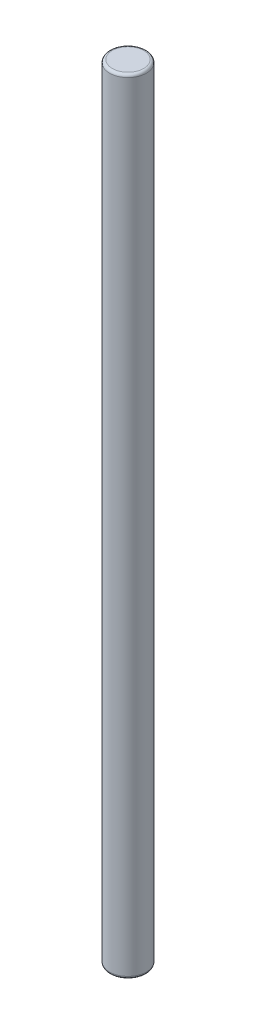
ISO-10303-21;
HEADER;
FILE_DESCRIPTION(('STEP AP214'),'2;1');
FILE_NAME('part.step','',(''),(''),'','','');
FILE_SCHEMA(('AUTOMOTIVE_DESIGN { 1 0 10303 214 1 1 1 1 }'));
ENDSEC;
DATA;
#1=APPLICATION_CONTEXT('core data for automotive mechanical design processes');
#2=APPLICATION_PROTOCOL_DEFINITION('international standard','automotive_design',2000,#1);
#3=PRODUCT_CONTEXT('',#1,'mechanical');
#4=PRODUCT('Part','Part','',(#3));
#5=PRODUCT_RELATED_PRODUCT_CATEGORY('part','',(#4));
#6=PRODUCT_DEFINITION_FORMATION('','',#4);
#7=PRODUCT_DEFINITION_CONTEXT('part definition',#1,'design');
#8=PRODUCT_DEFINITION('design','',#6,#7);
#9=PRODUCT_DEFINITION_SHAPE('','',#8);
#10=(LENGTH_UNIT() NAMED_UNIT(*) SI_UNIT(.MILLI.,.METRE.));
#11=(NAMED_UNIT(*) PLANE_ANGLE_UNIT() SI_UNIT($,.RADIAN.));
#12=(NAMED_UNIT(*) SI_UNIT($,.STERADIAN.) SOLID_ANGLE_UNIT());
#13=UNCERTAINTY_MEASURE_WITH_UNIT(LENGTH_MEASURE(1.E-05),#10,'distance_accuracy_value','');
#14=(GEOMETRIC_REPRESENTATION_CONTEXT(3) GLOBAL_UNCERTAINTY_ASSIGNED_CONTEXT((#13)) GLOBAL_UNIT_ASSIGNED_CONTEXT((#10,
#11,#12)) REPRESENTATION_CONTEXT('',''));
#15=CARTESIAN_POINT('',(0.,0.,0.));
#16=DIRECTION('',(0.,0.,1.));
#17=DIRECTION('',(1.,0.,0.));
#18=AXIS2_PLACEMENT_3D('',#15,#16,#17);
#19=CARTESIAN_POINT('',(0.,7.3152,0.));
#20=DIRECTION('',(0.,-1.,0.));
#21=DIRECTION('',(0.,0.,-1.));
#22=AXIS2_PLACEMENT_3D('',#19,#20,#21);
#23=CYLINDRICAL_SURFACE('',#22,0.17145);
#24=CARTESIAN_POINT('',(0.,0.0254000000000001,0.));
#25=DIRECTION('',(0.,1.,0.));
#26=DIRECTION('',(0.,0.,1.));
#27=AXIS2_PLACEMENT_3D('',#24,#25,#26);
#28=CIRCLE('',#27,0.17145);
#29=CARTESIAN_POINT('',(0.,0.0254000000000001,0.17145));
#30=VERTEX_POINT('',#29);
#31=EDGE_CURVE('E56',#30,#30,#28,.T.);
#32=ORIENTED_EDGE('',*,*,#31,.T.);
#33=EDGE_LOOP('',(#32));
#34=FACE_BOUND('',#33,.T.);
#35=CARTESIAN_POINT('',(0.,7.2898,0.));
#36=DIRECTION('',(0.,1.,0.));
#37=DIRECTION('',(0.,0.,1.));
#38=AXIS2_PLACEMENT_3D('',#35,#36,#37);
#39=CIRCLE('',#38,0.17145);
#40=CARTESIAN_POINT('',(0.,7.2898,0.17145));
#41=VERTEX_POINT('',#40);
#42=EDGE_CURVE('E62',#41,#41,#39,.F.);
#43=ORIENTED_EDGE('',*,*,#42,.T.);
#44=EDGE_LOOP('',(#43));
#45=FACE_BOUND('',#44,.T.);
#46=ADVANCED_FACE('F42',(#34,#45),#23,.T.);
#47=CARTESIAN_POINT('',(0.,7.3152,0.));
#48=DIRECTION('',(0.,1.,0.));
#49=DIRECTION('',(0.,0.,1.));
#50=AXIS2_PLACEMENT_3D('',#47,#48,#49);
#51=PLANE('',#50);
#52=CARTESIAN_POINT('',(0.,7.3152,0.));
#53=DIRECTION('',(0.,1.,0.));
#54=DIRECTION('',(0.,0.,1.));
#55=AXIS2_PLACEMENT_3D('',#52,#53,#54);
#56=CIRCLE('',#55,0.14605);
#57=CARTESIAN_POINT('',(0.,7.3152,0.14605));
#58=VERTEX_POINT('',#57);
#59=EDGE_CURVE('E10',#58,#58,#56,.T.);
#60=ORIENTED_EDGE('',*,*,#59,.T.);
#61=EDGE_LOOP('',(#60));
#62=FACE_BOUND('',#61,.T.);
#63=ADVANCED_FACE('F80',(#62),#51,.T.);
#64=CARTESIAN_POINT('',(0.,0.,0.));
#65=DIRECTION('',(0.,1.,0.));
#66=DIRECTION('',(0.,0.,1.));
#67=AXIS2_PLACEMENT_3D('',#64,#65,#66);
#68=PLANE('',#67);
#69=CARTESIAN_POINT('',(0.,0.,0.));
#70=DIRECTION('',(0.,1.,0.));
#71=DIRECTION('',(0.,0.,1.));
#72=AXIS2_PLACEMENT_3D('',#69,#70,#71);
#73=CIRCLE('',#72,0.14605);
#74=CARTESIAN_POINT('',(0.,0.,0.14605));
#75=VERTEX_POINT('',#74);
#76=EDGE_CURVE('E50',#75,#75,#73,.F.);
#77=ORIENTED_EDGE('',*,*,#76,.T.);
#78=EDGE_LOOP('',(#77));
#79=FACE_BOUND('',#78,.T.);
#80=ADVANCED_FACE('F77',(#79),#68,.F.);
#81=CARTESIAN_POINT('',(0.,0.0254000000000001,0.));
#82=DIRECTION('',(0.,1.,0.));
#83=DIRECTION('',(0.,0.,1.));
#84=AXIS2_PLACEMENT_3D('',#81,#82,#83);
#85=TOROIDAL_SURFACE('',#84,0.14605,0.0254);
#86=ORIENTED_EDGE('',*,*,#76,.F.);
#87=EDGE_LOOP('',(#86));
#88=FACE_BOUND('',#87,.T.);
#89=ORIENTED_EDGE('',*,*,#31,.F.);
#90=EDGE_LOOP('',(#89));
#91=FACE_BOUND('',#90,.T.);
#92=ADVANCED_FACE('F73',(#88,#91),#85,.T.);
#93=CARTESIAN_POINT('',(0.,7.2898,0.));
#94=DIRECTION('',(0.,1.,0.));
#95=DIRECTION('',(0.,0.,1.));
#96=AXIS2_PLACEMENT_3D('',#93,#94,#95);
#97=TOROIDAL_SURFACE('',#96,0.14605,0.0254);
#98=ORIENTED_EDGE('',*,*,#42,.F.);
#99=EDGE_LOOP('',(#98));
#100=FACE_BOUND('',#99,.T.);
#101=ORIENTED_EDGE('',*,*,#59,.F.);
#102=EDGE_LOOP('',(#101));
#103=FACE_BOUND('',#102,.T.);
#104=ADVANCED_FACE('F44',(#100,#103),#97,.T.);
#105=CLOSED_SHELL('',(#46,#63,#80,#92,#104));
#106=MANIFOLD_SOLID_BREP('B2',#105);
#107=ADVANCED_BREP_SHAPE_REPRESENTATION('',(#18,#106),#14);
#108=SHAPE_DEFINITION_REPRESENTATION(#9,#107);
ENDSEC;
END-ISO-10303-21;
